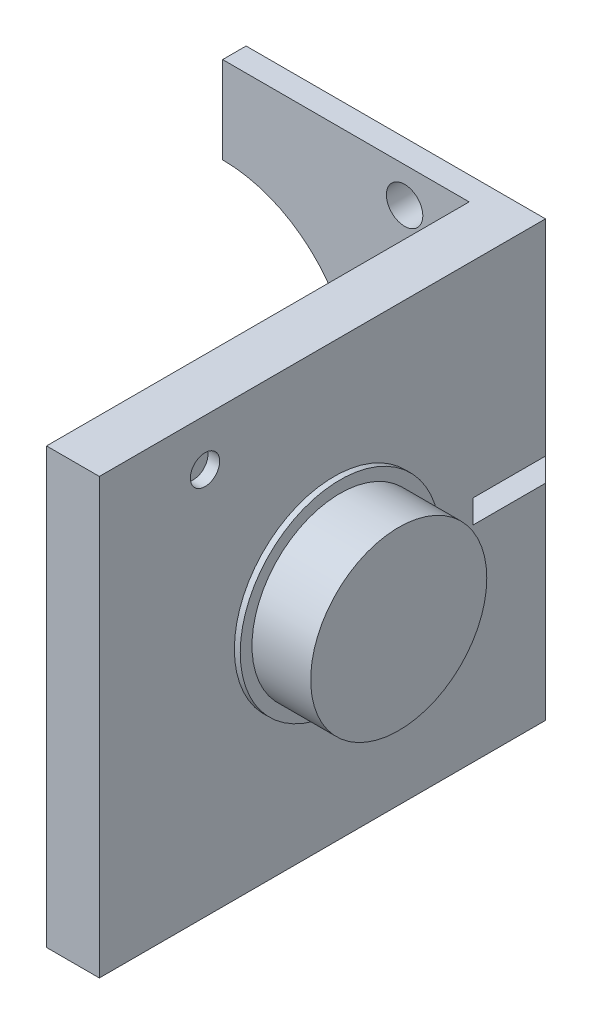
ISO-10303-21;
HEADER;
FILE_DESCRIPTION(('STEP AP214'),'2;1');
FILE_NAME('part.step','',(''),(''),'','','');
FILE_SCHEMA(('AUTOMOTIVE_DESIGN { 1 0 10303 214 1 1 1 1 }'));
ENDSEC;
DATA;
#1=APPLICATION_CONTEXT('core data for automotive mechanical design processes');
#2=APPLICATION_PROTOCOL_DEFINITION('international standard','automotive_design',2000,#1);
#3=PRODUCT_CONTEXT('',#1,'mechanical');
#4=PRODUCT('Part','Part','',(#3));
#5=PRODUCT_RELATED_PRODUCT_CATEGORY('part','',(#4));
#6=PRODUCT_DEFINITION_FORMATION('','',#4);
#7=PRODUCT_DEFINITION_CONTEXT('part definition',#1,'design');
#8=PRODUCT_DEFINITION('design','',#6,#7);
#9=PRODUCT_DEFINITION_SHAPE('','',#8);
#10=(LENGTH_UNIT() NAMED_UNIT(*) SI_UNIT(.MILLI.,.METRE.));
#11=(NAMED_UNIT(*) PLANE_ANGLE_UNIT() SI_UNIT($,.RADIAN.));
#12=(NAMED_UNIT(*) SI_UNIT($,.STERADIAN.) SOLID_ANGLE_UNIT());
#13=UNCERTAINTY_MEASURE_WITH_UNIT(LENGTH_MEASURE(1.E-05),#10,'distance_accuracy_value','');
#14=(GEOMETRIC_REPRESENTATION_CONTEXT(3) GLOBAL_UNCERTAINTY_ASSIGNED_CONTEXT((#13)) GLOBAL_UNIT_ASSIGNED_CONTEXT((#10,
#11,#12)) REPRESENTATION_CONTEXT('',''));
#15=CARTESIAN_POINT('',(0.,0.,0.));
#16=DIRECTION('',(0.,0.,1.));
#17=DIRECTION('',(1.,0.,0.));
#18=AXIS2_PLACEMENT_3D('',#15,#16,#17);
#19=CARTESIAN_POINT('',(4.5,0.,-28.));
#20=DIRECTION('',(-0.707106781186545,0.,0.70710678118655));
#21=DIRECTION('',(0.,1.,0.));
#22=AXIS2_PLACEMENT_3D('',#19,#20,#21);
#23=PLANE('',#22);
#24=DIRECTION('',(-0.70710678118655,0.,-0.707106781186545));
#25=VECTOR('',#24,1.);
#26=CARTESIAN_POINT('',(4.5,19.5,-28.));
#27=LINE('',#26,#25);
#28=CARTESIAN_POINT('',(2.5,19.5,-30.));
#29=VERTEX_POINT('',#28);
#30=CARTESIAN_POINT('',(4.5,19.5,-28.));
#31=VERTEX_POINT('',#30);
#32=EDGE_CURVE('E11',#29,#31,#27,.F.);
#33=ORIENTED_EDGE('',*,*,#32,.F.);
#34=DIRECTION('',(0.,-1.,0.));
#35=VECTOR('',#34,1.);
#36=CARTESIAN_POINT('',(2.49999999999998,0.,-30.));
#37=LINE('',#36,#35);
#38=CARTESIAN_POINT('',(2.49999999999998,35.,-30.));
#39=VERTEX_POINT('',#38);
#40=EDGE_CURVE('E264',#39,#29,#37,.T.);
#41=ORIENTED_EDGE('',*,*,#40,.F.);
#42=DIRECTION('',(-0.577350269189627,-0.577350269189627,-0.577350269189623));
#43=VECTOR('',#42,1.);
#44=CARTESIAN_POINT('',(4.5,37.,-28.));
#45=LINE('',#44,#43);
#46=CARTESIAN_POINT('',(4.5,37.,-28.));
#47=VERTEX_POINT('',#46);
#48=EDGE_CURVE('E229',#39,#47,#45,.F.);
#49=ORIENTED_EDGE('',*,*,#48,.T.);
#50=DIRECTION('',(0.,1.,0.));
#51=VECTOR('',#50,1.);
#52=CARTESIAN_POINT('',(4.5,0.,-28.));
#53=LINE('',#52,#51);
#54=EDGE_CURVE('E279',#31,#47,#53,.T.);
#55=ORIENTED_EDGE('',*,*,#54,.F.);
#56=EDGE_LOOP('',(#33,#41,#49,#55));
#57=FACE_BOUND('',#56,.T.);
#58=ADVANCED_FACE('F42',(#57),#23,.F.);
#59=CARTESIAN_POINT('',(4.5,0.,0.));
#60=DIRECTION('',(0.,1.,0.));
#61=DIRECTION('',(0.,0.,1.));
#62=AXIS2_PLACEMENT_3D('',#59,#60,#61);
#63=PLANE('',#62);
#64=DIRECTION('',(0.,0.,1.));
#65=VECTOR('',#64,1.);
#66=CARTESIAN_POINT('',(-21.,0.,0.));
#67=LINE('',#66,#65);
#68=CARTESIAN_POINT('',(-21.,0.,-28.));
#69=VERTEX_POINT('',#68);
#70=CARTESIAN_POINT('',(-21.,0.,-26.));
#71=VERTEX_POINT('',#70);
#72=EDGE_CURVE('E186',#69,#71,#67,.T.);
#73=ORIENTED_EDGE('',*,*,#72,.F.);
#74=DIRECTION('',(1.,0.,0.));
#75=VECTOR('',#74,1.);
#76=CARTESIAN_POINT('',(4.5,0.,-28.));
#77=LINE('',#76,#75);
#78=CARTESIAN_POINT('',(4.5,0.,-28.));
#79=VERTEX_POINT('',#78);
#80=EDGE_CURVE('E277',#69,#79,#77,.T.);
#81=ORIENTED_EDGE('',*,*,#80,.T.);
#82=DIRECTION('',(0.,0.,-1.));
#83=VECTOR('',#82,1.);
#84=CARTESIAN_POINT('',(4.5,0.,0.));
#85=LINE('',#84,#83);
#86=CARTESIAN_POINT('',(4.5,0.,10.));
#87=VERTEX_POINT('',#86);
#88=EDGE_CURVE('E252',#87,#79,#85,.T.);
#89=ORIENTED_EDGE('',*,*,#88,.F.);
#90=DIRECTION('',(1.,0.,0.));
#91=VECTOR('',#90,1.);
#92=CARTESIAN_POINT('',(4.5,0.,10.));
#93=LINE('',#92,#91);
#94=CARTESIAN_POINT('',(0.,0.,10.));
#95=VERTEX_POINT('',#94);
#96=EDGE_CURVE('E208',#95,#87,#93,.T.);
#97=ORIENTED_EDGE('',*,*,#96,.F.);
#98=DIRECTION('',(0.,0.,-1.));
#99=VECTOR('',#98,1.);
#100=CARTESIAN_POINT('',(0.,0.,0.));
#101=LINE('',#100,#99);
#102=CARTESIAN_POINT('',(0.,0.,-26.));
#103=VERTEX_POINT('',#102);
#104=EDGE_CURVE('E251',#95,#103,#101,.T.);
#105=ORIENTED_EDGE('',*,*,#104,.T.);
#106=DIRECTION('',(1.,0.,0.));
#107=VECTOR('',#106,1.);
#108=CARTESIAN_POINT('',(-42.,0.,-26.));
#109=LINE('',#108,#107);
#110=EDGE_CURVE('E249',#71,#103,#109,.T.);
#111=ORIENTED_EDGE('',*,*,#110,.F.);
#112=EDGE_LOOP('',(#73,#81,#89,#97,#105,#111));
#113=FACE_BOUND('',#112,.T.);
#114=ADVANCED_FACE('F323',(#113),#63,.F.);
#115=CARTESIAN_POINT('',(4.5,0.,-30.));
#116=DIRECTION('',(0.,0.,1.));
#117=DIRECTION('',(1.,0.,0.));
#118=AXIS2_PLACEMENT_3D('',#115,#116,#117);
#119=PLANE('',#118);
#120=DIRECTION('',(0.,-1.,0.));
#121=VECTOR('',#120,1.);
#122=CARTESIAN_POINT('',(-21.,0.,-30.));
#123=LINE('',#122,#121);
#124=CARTESIAN_POINT('',(-21.,35.,-30.));
#125=VERTEX_POINT('',#124);
#126=CARTESIAN_POINT('',(-21.,29.6,-30.));
#127=VERTEX_POINT('',#126);
#128=EDGE_CURVE('E187',#125,#127,#123,.T.);
#129=ORIENTED_EDGE('',*,*,#128,.F.);
#130=DIRECTION('',(1.,0.,0.));
#131=VECTOR('',#130,1.);
#132=CARTESIAN_POINT('',(4.5,35.,-30.));
#133=LINE('',#132,#131);
#134=CARTESIAN_POINT('',(-6.68427192823273,35.,-30.));
#135=VERTEX_POINT('',#134);
#136=EDGE_CURVE('E270',#125,#135,#133,.T.);
#137=ORIENTED_EDGE('',*,*,#136,.T.);
#138=CARTESIAN_POINT('',(-5.5,34.,-30.));
#139=DIRECTION('',(0.,0.,-1.));
#140=DIRECTION('',(-1.,0.,0.));
#141=AXIS2_PLACEMENT_3D('',#138,#139,#140);
#142=CIRCLE('',#141,1.55);
#143=CARTESIAN_POINT('',(-4.31572807176727,35.,-30.));
#144=VERTEX_POINT('',#143);
#145=EDGE_CURVE('E232',#144,#135,#142,.T.);
#146=ORIENTED_EDGE('',*,*,#145,.F.);
#147=DIRECTION('',(1.,0.,0.));
#148=VECTOR('',#147,1.);
#149=CARTESIAN_POINT('',(4.5,35.,-30.));
#150=LINE('',#149,#148);
#151=EDGE_CURVE('E258',#144,#39,#150,.T.);
#152=ORIENTED_EDGE('',*,*,#151,.T.);
#153=ORIENTED_EDGE('',*,*,#40,.T.);
#154=DIRECTION('',(0.,1.,0.));
#155=VECTOR('',#154,1.);
#156=CARTESIAN_POINT('',(2.5,17.5,-30.));
#157=LINE('',#156,#155);
#158=CARTESIAN_POINT('',(2.49999999999998,17.5,-30.));
#159=VERTEX_POINT('',#158);
#160=EDGE_CURVE('E170',#159,#29,#157,.T.);
#161=ORIENTED_EDGE('',*,*,#160,.F.);
#162=CARTESIAN_POINT('',(2.49999999999998,2.00000000000002,-30.));
#163=VERTEX_POINT('',#162);
#164=EDGE_CURVE('E263',#159,#163,#37,.T.);
#165=ORIENTED_EDGE('',*,*,#164,.T.);
#166=DIRECTION('',(-1.,0.,0.));
#167=VECTOR('',#166,1.);
#168=CARTESIAN_POINT('',(4.5,2.00000000000002,-30.));
#169=LINE('',#168,#167);
#170=CARTESIAN_POINT('',(-4.31572807176728,2.00000000000002,-30.));
#171=VERTEX_POINT('',#170);
#172=EDGE_CURVE('E267',#163,#171,#169,.T.);
#173=ORIENTED_EDGE('',*,*,#172,.T.);
#174=CARTESIAN_POINT('',(-5.5,3.,-30.));
#175=DIRECTION('',(0.,0.,-1.));
#176=DIRECTION('',(-1.,0.,0.));
#177=AXIS2_PLACEMENT_3D('',#174,#175,#176);
#178=CIRCLE('',#177,1.55);
#179=CARTESIAN_POINT('',(-6.68427192823272,2.00000000000002,-30.));
#180=VERTEX_POINT('',#179);
#181=EDGE_CURVE('E225',#180,#171,#178,.T.);
#182=ORIENTED_EDGE('',*,*,#181,.F.);
#183=DIRECTION('',(-1.,0.,0.));
#184=VECTOR('',#183,1.);
#185=CARTESIAN_POINT('',(4.5,2.00000000000002,-30.));
#186=LINE('',#185,#184);
#187=CARTESIAN_POINT('',(-21.,2.00000000000002,-30.));
#188=VERTEX_POINT('',#187);
#189=EDGE_CURVE('E272',#180,#188,#186,.T.);
#190=ORIENTED_EDGE('',*,*,#189,.T.);
#191=CARTESIAN_POINT('',(-21.,7.4,-30.));
#192=VERTEX_POINT('',#191);
#193=EDGE_CURVE('E183',#192,#188,#123,.T.);
#194=ORIENTED_EDGE('',*,*,#193,.F.);
#195=CARTESIAN_POINT('',(-21.,18.5,-30.));
#196=DIRECTION('',(0.,0.,1.));
#197=DIRECTION('',(1.,0.,0.));
#198=AXIS2_PLACEMENT_3D('',#195,#196,#197);
#199=CIRCLE('',#198,11.1);
#200=EDGE_CURVE('E241',#127,#192,#199,.F.);
#201=ORIENTED_EDGE('',*,*,#200,.F.);
#202=EDGE_LOOP('',(#129,#137,#146,#152,#153,#161,#165,#173,#182,#190,#194,#201));
#203=FACE_BOUND('',#202,.T.);
#204=ADVANCED_FACE('F309',(#203),#119,.F.);
#205=CARTESIAN_POINT('',(4.5,37.,0.));
#206=DIRECTION('',(0.,-1.,0.));
#207=DIRECTION('',(0.,0.,-1.));
#208=AXIS2_PLACEMENT_3D('',#205,#206,#207);
#209=PLANE('',#208);
#210=DIRECTION('',(0.,0.,-1.));
#211=VECTOR('',#210,1.);
#212=CARTESIAN_POINT('',(-21.,37.,0.));
#213=LINE('',#212,#211);
#214=CARTESIAN_POINT('',(-21.,37.,-26.));
#215=VERTEX_POINT('',#214);
#216=CARTESIAN_POINT('',(-21.,37.,-28.));
#217=VERTEX_POINT('',#216);
#218=EDGE_CURVE('E65',#215,#217,#213,.T.);
#219=ORIENTED_EDGE('',*,*,#218,.F.);
#220=DIRECTION('',(1.,0.,0.));
#221=VECTOR('',#220,1.);
#222=CARTESIAN_POINT('',(-42.,37.,-26.));
#223=LINE('',#222,#221);
#224=CARTESIAN_POINT('',(0.,37.,-26.));
#225=VERTEX_POINT('',#224);
#226=EDGE_CURVE('E247',#215,#225,#223,.T.);
#227=ORIENTED_EDGE('',*,*,#226,.T.);
#228=DIRECTION('',(0.,0.,1.));
#229=VECTOR('',#228,1.);
#230=CARTESIAN_POINT('',(0.,37.,0.));
#231=LINE('',#230,#229);
#232=CARTESIAN_POINT('',(0.,37.,10.));
#233=VERTEX_POINT('',#232);
#234=EDGE_CURVE('E256',#225,#233,#231,.T.);
#235=ORIENTED_EDGE('',*,*,#234,.T.);
#236=DIRECTION('',(-1.,0.,0.));
#237=VECTOR('',#236,1.);
#238=CARTESIAN_POINT('',(0.,37.,10.));
#239=LINE('',#238,#237);
#240=CARTESIAN_POINT('',(4.5,37.,10.));
#241=VERTEX_POINT('',#240);
#242=EDGE_CURVE('E214',#241,#233,#239,.T.);
#243=ORIENTED_EDGE('',*,*,#242,.F.);
#244=DIRECTION('',(0.,0.,1.));
#245=VECTOR('',#244,1.);
#246=CARTESIAN_POINT('',(4.5,37.,0.));
#247=LINE('',#246,#245);
#248=EDGE_CURVE('E255',#47,#241,#247,.T.);
#249=ORIENTED_EDGE('',*,*,#248,.F.);
#250=DIRECTION('',(-1.,0.,0.));
#251=VECTOR('',#250,1.);
#252=CARTESIAN_POINT('',(4.5,37.,-28.));
#253=LINE('',#252,#251);
#254=EDGE_CURVE('E283',#47,#217,#253,.T.);
#255=ORIENTED_EDGE('',*,*,#254,.T.);
#256=EDGE_LOOP('',(#219,#227,#235,#243,#249,#255));
#257=FACE_BOUND('',#256,.T.);
#258=ADVANCED_FACE('F363',(#257),#209,.F.);
#259=CARTESIAN_POINT('',(-42.,37.,-26.));
#260=DIRECTION('',(0.,0.,-1.));
#261=DIRECTION('',(-1.,0.,0.));
#262=AXIS2_PLACEMENT_3D('',#259,#260,#261);
#263=PLANE('',#262);
#264=CARTESIAN_POINT('',(-5.5,34.,-26.));
#265=DIRECTION('',(0.,0.,-1.));
#266=DIRECTION('',(-1.,0.,0.));
#267=AXIS2_PLACEMENT_3D('',#264,#265,#266);
#268=CIRCLE('',#267,1.55);
#269=CARTESIAN_POINT('',(-7.05000000000001,34.,-26.));
#270=VERTEX_POINT('',#269);
#271=EDGE_CURVE('E235',#270,#270,#268,.F.);
#272=ORIENTED_EDGE('',*,*,#271,.F.);
#273=EDGE_LOOP('',(#272));
#274=FACE_BOUND('',#273,.T.);
#275=CARTESIAN_POINT('',(-5.5,3.,-26.));
#276=DIRECTION('',(0.,0.,-1.));
#277=DIRECTION('',(-1.,0.,0.));
#278=AXIS2_PLACEMENT_3D('',#275,#276,#277);
#279=CIRCLE('',#278,1.55);
#280=CARTESIAN_POINT('',(-7.05,3.,-26.));
#281=VERTEX_POINT('',#280);
#282=EDGE_CURVE('E228',#281,#281,#279,.F.);
#283=ORIENTED_EDGE('',*,*,#282,.F.);
#284=EDGE_LOOP('',(#283));
#285=FACE_BOUND('',#284,.T.);
#286=DIRECTION('',(0.,1.,0.));
#287=VECTOR('',#286,1.);
#288=CARTESIAN_POINT('',(-21.,37.,-26.));
#289=LINE('',#288,#287);
#290=CARTESIAN_POINT('',(-21.,7.4,-26.));
#291=VERTEX_POINT('',#290);
#292=EDGE_CURVE('E191',#71,#291,#289,.T.);
#293=ORIENTED_EDGE('',*,*,#292,.F.);
#294=ORIENTED_EDGE('',*,*,#110,.T.);
#295=DIRECTION('',(0.,1.,0.));
#296=VECTOR('',#295,1.);
#297=CARTESIAN_POINT('',(0.,37.,-26.));
#298=LINE('',#297,#296);
#299=EDGE_CURVE('E244',#103,#225,#298,.T.);
#300=ORIENTED_EDGE('',*,*,#299,.T.);
#301=ORIENTED_EDGE('',*,*,#226,.F.);
#302=CARTESIAN_POINT('',(-21.,29.6,-26.));
#303=VERTEX_POINT('',#302);
#304=EDGE_CURVE('E194',#303,#215,#289,.T.);
#305=ORIENTED_EDGE('',*,*,#304,.F.);
#306=CARTESIAN_POINT('',(-21.,18.5,-26.));
#307=DIRECTION('',(0.,0.,1.));
#308=DIRECTION('',(1.,0.,0.));
#309=AXIS2_PLACEMENT_3D('',#306,#307,#308);
#310=CIRCLE('',#309,11.1);
#311=EDGE_CURVE('E238',#291,#303,#310,.T.);
#312=ORIENTED_EDGE('',*,*,#311,.F.);
#313=EDGE_LOOP('',(#293,#294,#300,#301,#305,#312));
#314=FACE_BOUND('',#313,.T.);
#315=ADVANCED_FACE('F335',(#274,#285,#314),#263,.F.);
#316=CARTESIAN_POINT('',(-21.,18.5,-61.3955410846827));
#317=DIRECTION('',(0.,0.,1.));
#318=DIRECTION('',(1.,0.,0.));
#319=AXIS2_PLACEMENT_3D('',#316,#317,#318);
#320=CYLINDRICAL_SURFACE('',#319,11.1);
#321=DIRECTION('',(0.,0.,1.));
#322=VECTOR('',#321,1.);
#323=CARTESIAN_POINT('',(-21.,7.4,-61.3955410846827));
#324=LINE('',#323,#322);
#325=EDGE_CURVE('E189',#291,#192,#324,.F.);
#326=ORIENTED_EDGE('',*,*,#325,.F.);
#327=ORIENTED_EDGE('',*,*,#311,.T.);
#328=DIRECTION('',(0.,0.,1.));
#329=VECTOR('',#328,1.);
#330=CARTESIAN_POINT('',(-21.,29.6,-61.3955410846827));
#331=LINE('',#330,#329);
#332=EDGE_CURVE('E197',#127,#303,#331,.T.);
#333=ORIENTED_EDGE('',*,*,#332,.F.);
#334=ORIENTED_EDGE('',*,*,#200,.T.);
#335=EDGE_LOOP('',(#326,#327,#333,#334));
#336=FACE_BOUND('',#335,.T.);
#337=ADVANCED_FACE('F342',(#336),#320,.F.);
#338=CARTESIAN_POINT('',(4.5,37.,-28.));
#339=DIRECTION('',(0.,-0.707106781186545,0.70710678118655));
#340=DIRECTION('',(-1.,0.,0.));
#341=AXIS2_PLACEMENT_3D('',#338,#339,#340);
#342=PLANE('',#341);
#343=ORIENTED_EDGE('',*,*,#136,.F.);
#344=DIRECTION('',(0.,-0.70710678118655,-0.707106781186545));
#345=VECTOR('',#344,1.);
#346=CARTESIAN_POINT('',(-21.,37.,-28.));
#347=LINE('',#346,#345);
#348=EDGE_CURVE('E193',#125,#217,#347,.F.);
#349=ORIENTED_EDGE('',*,*,#348,.T.);
#350=ORIENTED_EDGE('',*,*,#254,.F.);
#351=ORIENTED_EDGE('',*,*,#48,.F.);
#352=ORIENTED_EDGE('',*,*,#151,.F.);
#353=CARTESIAN_POINT('',(-5.5,34.,-31.));
#354=DIRECTION('',(0.,-0.707106781186545,0.70710678118655));
#355=DIRECTION('',(0.,-0.70710678118655,-0.707106781186545));
#356=AXIS2_PLACEMENT_3D('',#353,#354,#355);
#357=ELLIPSE('',#356,2.1920310216783,1.55);
#358=EDGE_CURVE('E286',#135,#144,#357,.F.);
#359=ORIENTED_EDGE('',*,*,#358,.F.);
#360=EDGE_LOOP('',(#343,#349,#350,#351,#352,#359));
#361=FACE_BOUND('',#360,.T.);
#362=ADVANCED_FACE('F44',(#361),#342,.F.);
#363=CARTESIAN_POINT('',(4.5,2.00000000000002,-30.));
#364=DIRECTION('',(0.,0.707106781186545,0.70710678118655));
#365=DIRECTION('',(-1.,0.,0.));
#366=AXIS2_PLACEMENT_3D('',#363,#364,#365);
#367=PLANE('',#366);
#368=ORIENTED_EDGE('',*,*,#80,.F.);
#369=DIRECTION('',(0.,-0.70710678118655,0.707106781186545));
#370=VECTOR('',#369,1.);
#371=CARTESIAN_POINT('',(-21.,2.00000000000002,-30.));
#372=LINE('',#371,#370);
#373=EDGE_CURVE('E297',#69,#188,#372,.F.);
#374=ORIENTED_EDGE('',*,*,#373,.T.);
#375=ORIENTED_EDGE('',*,*,#189,.F.);
#376=CARTESIAN_POINT('',(-5.5,3.,-31.));
#377=DIRECTION('',(0.,0.707106781186545,0.70710678118655));
#378=DIRECTION('',(0.,0.70710678118655,-0.707106781186545));
#379=AXIS2_PLACEMENT_3D('',#376,#377,#378);
#380=ELLIPSE('',#379,2.19203102167829,1.55);
#381=EDGE_CURVE('E275',#171,#180,#380,.F.);
#382=ORIENTED_EDGE('',*,*,#381,.F.);
#383=ORIENTED_EDGE('',*,*,#172,.F.);
#384=DIRECTION('',(-0.577350269189627,0.577350269189627,-0.577350269189623));
#385=VECTOR('',#384,1.);
#386=CARTESIAN_POINT('',(4.5,0.,-28.));
#387=LINE('',#386,#385);
#388=EDGE_CURVE('E224',#163,#79,#387,.F.);
#389=ORIENTED_EDGE('',*,*,#388,.T.);
#390=EDGE_LOOP('',(#368,#374,#375,#382,#383,#389));
#391=FACE_BOUND('',#390,.T.);
#392=ADVANCED_FACE('F302',(#391),#367,.F.);
#393=CARTESIAN_POINT('',(4.5,0.,0.));
#394=DIRECTION('',(-1.,0.,0.));
#395=DIRECTION('',(0.,0.,1.));
#396=AXIS2_PLACEMENT_3D('',#393,#394,#395);
#397=PLANE('',#396);
#398=CARTESIAN_POINT('',(4.5,32.9999999999991,1.));
#399=DIRECTION('',(1.,0.,0.));
#400=DIRECTION('',(0.,0.,-1.));
#401=AXIS2_PLACEMENT_3D('',#398,#399,#400);
#402=CIRCLE('',#401,1.25);
#403=CARTESIAN_POINT('',(4.5,32.9999999999991,-0.25));
#404=VERTEX_POINT('',#403);
#405=EDGE_CURVE('E203',#404,#404,#402,.T.);
#406=ORIENTED_EDGE('',*,*,#405,.F.);
#407=EDGE_LOOP('',(#406));
#408=FACE_BOUND('',#407,.T.);
#409=CARTESIAN_POINT('',(4.5,18.5,-10.));
#410=DIRECTION('',(-1.,0.,0.));
#411=DIRECTION('',(0.,0.,1.));
#412=AXIS2_PLACEMENT_3D('',#409,#410,#411);
#413=CIRCLE('',#412,8.5);
#414=CARTESIAN_POINT('',(4.5,18.5,-1.5));
#415=VERTEX_POINT('',#414);
#416=EDGE_CURVE('E288',#415,#415,#413,.F.);
#417=ORIENTED_EDGE('',*,*,#416,.F.);
#418=EDGE_LOOP('',(#417));
#419=FACE_BOUND('',#418,.T.);
#420=DIRECTION('',(0.,-1.,0.));
#421=VECTOR('',#420,1.);
#422=CARTESIAN_POINT('',(4.5,17.5,-21.8401082764199));
#423=LINE('',#422,#421);
#424=CARTESIAN_POINT('',(4.5,19.5,-21.8401082764199));
#425=VERTEX_POINT('',#424);
#426=CARTESIAN_POINT('',(4.5,17.5,-21.8401082764199));
#427=VERTEX_POINT('',#426);
#428=EDGE_CURVE('E161',#425,#427,#423,.T.);
#429=ORIENTED_EDGE('',*,*,#428,.F.);
#430=DIRECTION('',(0.,0.,1.));
#431=VECTOR('',#430,1.);
#432=CARTESIAN_POINT('',(4.5,19.5,-21.8401082764199));
#433=LINE('',#432,#431);
#434=EDGE_CURVE('E174',#31,#425,#433,.T.);
#435=ORIENTED_EDGE('',*,*,#434,.F.);
#436=ORIENTED_EDGE('',*,*,#54,.T.);
#437=ORIENTED_EDGE('',*,*,#248,.T.);
#438=DIRECTION('',(0.,1.,0.));
#439=VECTOR('',#438,1.);
#440=CARTESIAN_POINT('',(4.5,37.,10.));
#441=LINE('',#440,#439);
#442=EDGE_CURVE('E211',#87,#241,#441,.T.);
#443=ORIENTED_EDGE('',*,*,#442,.F.);
#444=ORIENTED_EDGE('',*,*,#88,.T.);
#445=CARTESIAN_POINT('',(4.5,17.5,-28.));
#446=VERTEX_POINT('',#445);
#447=EDGE_CURVE('E280',#79,#446,#53,.T.);
#448=ORIENTED_EDGE('',*,*,#447,.T.);
#449=DIRECTION('',(0.,0.,-1.));
#450=VECTOR('',#449,1.);
#451=CARTESIAN_POINT('',(4.5,17.5,-21.8401082764199));
#452=LINE('',#451,#450);
#453=EDGE_CURVE('E176',#427,#446,#452,.T.);
#454=ORIENTED_EDGE('',*,*,#453,.F.);
#455=EDGE_LOOP('',(#429,#435,#436,#437,#443,#444,#448,#454));
#456=FACE_BOUND('',#455,.T.);
#457=ADVANCED_FACE('F320',(#408,#419,#456),#397,.F.);
#458=CARTESIAN_POINT('',(0.,0.,0.));
#459=DIRECTION('',(-1.,0.,0.));
#460=DIRECTION('',(0.,0.,1.));
#461=AXIS2_PLACEMENT_3D('',#458,#459,#460);
#462=PLANE('',#461);
#463=ORIENTED_EDGE('',*,*,#299,.F.);
#464=ORIENTED_EDGE('',*,*,#104,.F.);
#465=DIRECTION('',(0.,-1.,0.));
#466=VECTOR('',#465,1.);
#467=CARTESIAN_POINT('',(0.,0.,10.));
#468=LINE('',#467,#466);
#469=EDGE_CURVE('E202',#233,#95,#468,.T.);
#470=ORIENTED_EDGE('',*,*,#469,.F.);
#471=ORIENTED_EDGE('',*,*,#234,.F.);
#472=EDGE_LOOP('',(#463,#464,#470,#471));
#473=FACE_BOUND('',#472,.T.);
#474=ADVANCED_FACE('F331',(#473),#462,.T.);
#475=CARTESIAN_POINT('',(-5.5,34.,-21.6159379566434));
#476=DIRECTION('',(0.,0.,-1.));
#477=DIRECTION('',(-1.,0.,0.));
#478=AXIS2_PLACEMENT_3D('',#475,#476,#477);
#479=CYLINDRICAL_SURFACE('',#478,1.55);
#480=ORIENTED_EDGE('',*,*,#271,.T.);
#481=EDGE_LOOP('',(#480));
#482=FACE_BOUND('',#481,.T.);
#483=ORIENTED_EDGE('',*,*,#145,.T.);
#484=ORIENTED_EDGE('',*,*,#358,.T.);
#485=EDGE_LOOP('',(#483,#484));
#486=FACE_BOUND('',#485,.T.);
#487=ADVANCED_FACE('F352',(#482,#486),#479,.F.);
#488=CARTESIAN_POINT('',(-5.5,3.,-21.6159379566434));
#489=DIRECTION('',(0.,0.,-1.));
#490=DIRECTION('',(-1.,0.,0.));
#491=AXIS2_PLACEMENT_3D('',#488,#489,#490);
#492=CYLINDRICAL_SURFACE('',#491,1.55);
#493=ORIENTED_EDGE('',*,*,#282,.T.);
#494=EDGE_LOOP('',(#493));
#495=FACE_BOUND('',#494,.T.);
#496=ORIENTED_EDGE('',*,*,#181,.T.);
#497=ORIENTED_EDGE('',*,*,#381,.T.);
#498=EDGE_LOOP('',(#496,#497));
#499=FACE_BOUND('',#498,.T.);
#500=ADVANCED_FACE('F313',(#495,#499),#492,.F.);
#501=DIRECTION('',(0.70710678118655,0.,0.707106781186545));
#502=VECTOR('',#501,1.);
#503=CARTESIAN_POINT('',(4.5,17.5,-28.));
#504=LINE('',#503,#502);
#505=EDGE_CURVE('E50',#446,#159,#504,.F.);
#506=ORIENTED_EDGE('',*,*,#505,.F.);
#507=ORIENTED_EDGE('',*,*,#447,.F.);
#508=ORIENTED_EDGE('',*,*,#388,.F.);
#509=ORIENTED_EDGE('',*,*,#164,.F.);
#510=EDGE_LOOP('',(#506,#507,#508,#509));
#511=FACE_BOUND('',#510,.T.);
#512=ADVANCED_FACE('F317',(#511),#23,.F.);
#513=CARTESIAN_POINT('',(5.,18.5,-10.));
#514=DIRECTION('',(1.,0.,0.));
#515=DIRECTION('',(0.,0.,-1.));
#516=AXIS2_PLACEMENT_3D('',#513,#514,#515);
#517=PLANE('',#516);
#518=CARTESIAN_POINT('',(5.,18.5,-10.));
#519=DIRECTION('',(1.,0.,0.));
#520=DIRECTION('',(0.,0.,-1.));
#521=AXIS2_PLACEMENT_3D('',#518,#519,#520);
#522=CIRCLE('',#521,7.5);
#523=CARTESIAN_POINT('',(5.,18.5,-17.5));
#524=VERTEX_POINT('',#523);
#525=EDGE_CURVE('E220',#524,#524,#522,.T.);
#526=ORIENTED_EDGE('',*,*,#525,.F.);
#527=EDGE_LOOP('',(#526));
#528=FACE_BOUND('',#527,.T.);
#529=CARTESIAN_POINT('',(5.,18.5,-10.));
#530=DIRECTION('',(1.,0.,0.));
#531=DIRECTION('',(0.,0.,-1.));
#532=AXIS2_PLACEMENT_3D('',#529,#530,#531);
#533=CIRCLE('',#532,8.5);
#534=CARTESIAN_POINT('',(5.,18.5,-18.5));
#535=VERTEX_POINT('',#534);
#536=EDGE_CURVE('E217',#535,#535,#533,.T.);
#537=ORIENTED_EDGE('',*,*,#536,.T.);
#538=EDGE_LOOP('',(#537));
#539=FACE_BOUND('',#538,.T.);
#540=ADVANCED_FACE('F383',(#528,#539),#517,.T.);
#541=CARTESIAN_POINT('',(5.,18.5,-10.));
#542=DIRECTION('',(-1.,0.,0.));
#543=DIRECTION('',(0.,0.,1.));
#544=AXIS2_PLACEMENT_3D('',#541,#542,#543);
#545=CYLINDRICAL_SURFACE('',#544,8.5);
#546=ORIENTED_EDGE('',*,*,#536,.F.);
#547=EDGE_LOOP('',(#546));
#548=FACE_BOUND('',#547,.T.);
#549=ORIENTED_EDGE('',*,*,#416,.T.);
#550=EDGE_LOOP('',(#549));
#551=FACE_BOUND('',#550,.T.);
#552=ADVANCED_FACE('F389',(#548,#551),#545,.T.);
#553=CARTESIAN_POINT('',(10.,18.5,-10.));
#554=DIRECTION('',(1.,0.,0.));
#555=DIRECTION('',(0.,0.,-1.));
#556=AXIS2_PLACEMENT_3D('',#553,#554,#555);
#557=PLANE('',#556);
#558=CARTESIAN_POINT('',(10.,18.5,-10.));
#559=DIRECTION('',(1.,0.,0.));
#560=DIRECTION('',(0.,0.,-1.));
#561=AXIS2_PLACEMENT_3D('',#558,#559,#560);
#562=CIRCLE('',#561,7.5);
#563=CARTESIAN_POINT('',(10.,18.5,-17.5));
#564=VERTEX_POINT('',#563);
#565=EDGE_CURVE('E221',#564,#564,#562,.T.);
#566=ORIENTED_EDGE('',*,*,#565,.T.);
#567=EDGE_LOOP('',(#566));
#568=FACE_BOUND('',#567,.T.);
#569=ADVANCED_FACE('F494',(#568),#557,.T.);
#570=CARTESIAN_POINT('',(10.,18.5,-10.));
#571=DIRECTION('',(-1.,0.,0.));
#572=DIRECTION('',(0.,0.,1.));
#573=AXIS2_PLACEMENT_3D('',#570,#571,#572);
#574=CYLINDRICAL_SURFACE('',#573,7.5);
#575=ORIENTED_EDGE('',*,*,#525,.T.);
#576=EDGE_LOOP('',(#575));
#577=FACE_BOUND('',#576,.T.);
#578=ORIENTED_EDGE('',*,*,#565,.F.);
#579=EDGE_LOOP('',(#578));
#580=FACE_BOUND('',#579,.T.);
#581=ADVANCED_FACE('F401',(#577,#580),#574,.T.);
#582=CARTESIAN_POINT('',(0.,0.,10.));
#583=DIRECTION('',(0.,0.,-1.));
#584=DIRECTION('',(-1.,0.,0.));
#585=AXIS2_PLACEMENT_3D('',#582,#583,#584);
#586=PLANE('',#585);
#587=ORIENTED_EDGE('',*,*,#469,.T.);
#588=ORIENTED_EDGE('',*,*,#96,.T.);
#589=ORIENTED_EDGE('',*,*,#442,.T.);
#590=ORIENTED_EDGE('',*,*,#242,.T.);
#591=EDGE_LOOP('',(#587,#588,#589,#590));
#592=FACE_BOUND('',#591,.T.);
#593=ADVANCED_FACE('F325',(#592),#586,.F.);
#594=CARTESIAN_POINT('',(3.5,32.9999999999991,1.));
#595=DIRECTION('',(1.,0.,0.));
#596=DIRECTION('',(0.,0.,-1.));
#597=AXIS2_PLACEMENT_3D('',#594,#595,#596);
#598=CYLINDRICAL_SURFACE('',#597,1.25);
#599=CARTESIAN_POINT('',(3.5,32.9999999999991,1.));
#600=DIRECTION('',(1.,0.,0.));
#601=DIRECTION('',(0.,0.,-1.));
#602=AXIS2_PLACEMENT_3D('',#599,#600,#601);
#603=CIRCLE('',#602,1.25);
#604=CARTESIAN_POINT('',(3.5,32.9999999999991,-0.25));
#605=VERTEX_POINT('',#604);
#606=EDGE_CURVE('E199',#605,#605,#603,.T.);
#607=ORIENTED_EDGE('',*,*,#606,.F.);
#608=EDGE_LOOP('',(#607));
#609=FACE_BOUND('',#608,.T.);
#610=ORIENTED_EDGE('',*,*,#405,.T.);
#611=EDGE_LOOP('',(#610));
#612=FACE_BOUND('',#611,.T.);
#613=ADVANCED_FACE('F457',(#609,#612),#598,.F.);
#614=CARTESIAN_POINT('',(3.5,32.9999999999991,1.));
#615=DIRECTION('',(1.,0.,0.));
#616=DIRECTION('',(0.,0.,-1.));
#617=AXIS2_PLACEMENT_3D('',#614,#615,#616);
#618=PLANE('',#617);
#619=ORIENTED_EDGE('',*,*,#606,.T.);
#620=EDGE_LOOP('',(#619));
#621=FACE_BOUND('',#620,.T.);
#622=ADVANCED_FACE('F373',(#621),#618,.T.);
#623=CARTESIAN_POINT('',(-21.,0.,0.));
#624=DIRECTION('',(-1.,0.,0.));
#625=DIRECTION('',(0.,0.,1.));
#626=AXIS2_PLACEMENT_3D('',#623,#624,#625);
#627=PLANE('',#626);
#628=ORIENTED_EDGE('',*,*,#292,.T.);
#629=ORIENTED_EDGE('',*,*,#325,.T.);
#630=ORIENTED_EDGE('',*,*,#193,.T.);
#631=ORIENTED_EDGE('',*,*,#373,.F.);
#632=ORIENTED_EDGE('',*,*,#72,.T.);
#633=EDGE_LOOP('',(#628,#629,#630,#631,#632));
#634=FACE_BOUND('',#633,.T.);
#635=ADVANCED_FACE('F340',(#634),#627,.T.);
#636=ORIENTED_EDGE('',*,*,#304,.T.);
#637=ORIENTED_EDGE('',*,*,#218,.T.);
#638=ORIENTED_EDGE('',*,*,#348,.F.);
#639=ORIENTED_EDGE('',*,*,#128,.T.);
#640=ORIENTED_EDGE('',*,*,#332,.T.);
#641=EDGE_LOOP('',(#636,#637,#638,#639,#640));
#642=FACE_BOUND('',#641,.T.);
#643=ADVANCED_FACE('F364',(#642),#627,.T.);
#644=CARTESIAN_POINT('',(2.5,17.5,-21.8401082764199));
#645=DIRECTION('',(0.,0.,1.));
#646=DIRECTION('',(1.,0.,0.));
#647=AXIS2_PLACEMENT_3D('',#644,#645,#646);
#648=PLANE('',#647);
#649=ORIENTED_EDGE('',*,*,#428,.T.);
#650=DIRECTION('',(1.,0.,0.));
#651=VECTOR('',#650,1.);
#652=CARTESIAN_POINT('',(2.5,17.5,-21.8401082764199));
#653=LINE('',#652,#651);
#654=CARTESIAN_POINT('',(2.5,17.5,-21.8401082764199));
#655=VERTEX_POINT('',#654);
#656=EDGE_CURVE('E155',#655,#427,#653,.T.);
#657=ORIENTED_EDGE('',*,*,#656,.F.);
#658=DIRECTION('',(0.,-1.,0.));
#659=VECTOR('',#658,1.);
#660=CARTESIAN_POINT('',(2.5,17.5,-21.8401082764199));
#661=LINE('',#660,#659);
#662=CARTESIAN_POINT('',(2.5,19.5,-21.8401082764199));
#663=VERTEX_POINT('',#662);
#664=EDGE_CURVE('E158',#663,#655,#661,.T.);
#665=ORIENTED_EDGE('',*,*,#664,.F.);
#666=DIRECTION('',(1.,0.,0.));
#667=VECTOR('',#666,1.);
#668=CARTESIAN_POINT('',(2.5,19.5,-21.8401082764199));
#669=LINE('',#668,#667);
#670=EDGE_CURVE('E164',#663,#425,#669,.T.);
#671=ORIENTED_EDGE('',*,*,#670,.T.);
#672=EDGE_LOOP('',(#649,#657,#665,#671));
#673=FACE_BOUND('',#672,.T.);
#674=ADVANCED_FACE('F156',(#673),#648,.F.);
#675=CARTESIAN_POINT('',(2.5,19.5,-21.8401082764199));
#676=DIRECTION('',(0.,1.,0.));
#677=DIRECTION('',(0.,0.,1.));
#678=AXIS2_PLACEMENT_3D('',#675,#676,#677);
#679=PLANE('',#678);
#680=ORIENTED_EDGE('',*,*,#32,.T.);
#681=ORIENTED_EDGE('',*,*,#434,.T.);
#682=ORIENTED_EDGE('',*,*,#670,.F.);
#683=DIRECTION('',(0.,0.,1.));
#684=VECTOR('',#683,1.);
#685=CARTESIAN_POINT('',(2.5,19.5,-21.8401082764199));
#686=LINE('',#685,#684);
#687=EDGE_CURVE('E165',#29,#663,#686,.T.);
#688=ORIENTED_EDGE('',*,*,#687,.F.);
#689=EDGE_LOOP('',(#680,#681,#682,#688));
#690=FACE_BOUND('',#689,.T.);
#691=ADVANCED_FACE('F360',(#690),#679,.F.);
#692=CARTESIAN_POINT('',(2.5,17.5,-21.8401082764199));
#693=DIRECTION('',(0.,-1.,0.));
#694=DIRECTION('',(0.,0.,-1.));
#695=AXIS2_PLACEMENT_3D('',#692,#693,#694);
#696=PLANE('',#695);
#697=ORIENTED_EDGE('',*,*,#505,.T.);
#698=DIRECTION('',(0.,0.,-1.));
#699=VECTOR('',#698,1.);
#700=CARTESIAN_POINT('',(2.5,17.5,-21.8401082764199));
#701=LINE('',#700,#699);
#702=EDGE_CURVE('E57',#655,#159,#701,.T.);
#703=ORIENTED_EDGE('',*,*,#702,.F.);
#704=ORIENTED_EDGE('',*,*,#656,.T.);
#705=ORIENTED_EDGE('',*,*,#453,.T.);
#706=EDGE_LOOP('',(#697,#703,#704,#705));
#707=FACE_BOUND('',#706,.T.);
#708=ADVANCED_FACE('F167',(#707),#696,.F.);
#709=CARTESIAN_POINT('',(2.5,0.,0.));
#710=DIRECTION('',(-1.,0.,0.));
#711=DIRECTION('',(0.,0.,1.));
#712=AXIS2_PLACEMENT_3D('',#709,#710,#711);
#713=PLANE('',#712);
#714=ORIENTED_EDGE('',*,*,#664,.T.);
#715=ORIENTED_EDGE('',*,*,#702,.T.);
#716=ORIENTED_EDGE('',*,*,#160,.T.);
#717=ORIENTED_EDGE('',*,*,#687,.T.);
#718=EDGE_LOOP('',(#714,#715,#716,#717));
#719=FACE_BOUND('',#718,.T.);
#720=ADVANCED_FACE('F172',(#719),#713,.F.);
#721=CLOSED_SHELL('',(#58,#114,#204,#258,#315,#337,#362,#392,#457,#474,#487,#500,#512,#540,#552,
#569,#581,#593,#613,#622,#635,#643,#674,#691,#708,#720));
#722=MANIFOLD_SOLID_BREP('B2',#721);
#723=ADVANCED_BREP_SHAPE_REPRESENTATION('',(#18,#722),#14);
#724=SHAPE_DEFINITION_REPRESENTATION(#9,#723);
ENDSEC;
END-ISO-10303-21;
